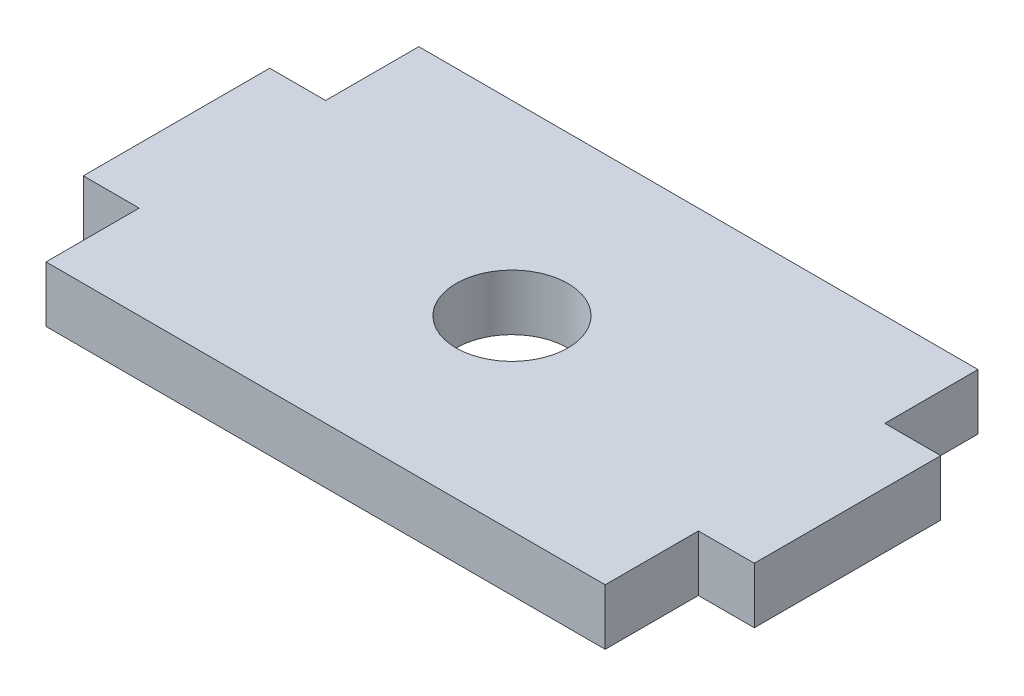
ISO-10303-21;
HEADER;
FILE_DESCRIPTION(('STEP AP214'),'2;1');
FILE_NAME('part.step','',(''),(''),'','','');
FILE_SCHEMA(('AUTOMOTIVE_DESIGN { 1 0 10303 214 1 1 1 1 }'));
ENDSEC;
DATA;
#1=APPLICATION_CONTEXT('core data for automotive mechanical design processes');
#2=APPLICATION_PROTOCOL_DEFINITION('international standard','automotive_design',2000,#1);
#3=PRODUCT_CONTEXT('',#1,'mechanical');
#4=PRODUCT('Part','Part','',(#3));
#5=PRODUCT_RELATED_PRODUCT_CATEGORY('part','',(#4));
#6=PRODUCT_DEFINITION_FORMATION('','',#4);
#7=PRODUCT_DEFINITION_CONTEXT('part definition',#1,'design');
#8=PRODUCT_DEFINITION('design','',#6,#7);
#9=PRODUCT_DEFINITION_SHAPE('','',#8);
#10=(LENGTH_UNIT() NAMED_UNIT(*) SI_UNIT(.MILLI.,.METRE.));
#11=(NAMED_UNIT(*) PLANE_ANGLE_UNIT() SI_UNIT($,.RADIAN.));
#12=(NAMED_UNIT(*) SI_UNIT($,.STERADIAN.) SOLID_ANGLE_UNIT());
#13=UNCERTAINTY_MEASURE_WITH_UNIT(LENGTH_MEASURE(1.E-05),#10,'distance_accuracy_value','');
#14=(GEOMETRIC_REPRESENTATION_CONTEXT(3) GLOBAL_UNCERTAINTY_ASSIGNED_CONTEXT((#13)) GLOBAL_UNIT_ASSIGNED_CONTEXT((#10,
#11,#12)) REPRESENTATION_CONTEXT('',''));
#15=CARTESIAN_POINT('',(0.,0.,0.));
#16=DIRECTION('',(0.,0.,1.));
#17=DIRECTION('',(1.,0.,0.));
#18=AXIS2_PLACEMENT_3D('',#15,#16,#17);
#19=CARTESIAN_POINT('',(0.,3.,0.));
#20=DIRECTION('',(0.,-1.,0.));
#21=DIRECTION('',(0.,0.,-1.));
#22=AXIS2_PLACEMENT_3D('',#19,#20,#21);
#23=PLANE('',#22);
#24=DIRECTION('',(0.,0.,1.));
#25=VECTOR('',#24,1.);
#26=CARTESIAN_POINT('',(-15.,3.,5.));
#27=LINE('',#26,#25);
#28=CARTESIAN_POINT('',(-15.,3.,5.));
#29=VERTEX_POINT('',#28);
#30=CARTESIAN_POINT('',(-15.,3.,10.));
#31=VERTEX_POINT('',#30);
#32=EDGE_CURVE('E177',#29,#31,#27,.T.);
#33=ORIENTED_EDGE('',*,*,#32,.T.);
#34=DIRECTION('',(1.,0.,0.));
#35=VECTOR('',#34,1.);
#36=CARTESIAN_POINT('',(15.,3.,10.));
#37=LINE('',#36,#35);
#38=CARTESIAN_POINT('',(15.,3.,10.));
#39=VERTEX_POINT('',#38);
#40=EDGE_CURVE('E105',#31,#39,#37,.T.);
#41=ORIENTED_EDGE('',*,*,#40,.T.);
#42=DIRECTION('',(0.,0.,-1.));
#43=VECTOR('',#42,1.);
#44=CARTESIAN_POINT('',(15.,3.,10.));
#45=LINE('',#44,#43);
#46=CARTESIAN_POINT('',(15.,3.,5.));
#47=VERTEX_POINT('',#46);
#48=EDGE_CURVE('E204',#39,#47,#45,.T.);
#49=ORIENTED_EDGE('',*,*,#48,.T.);
#50=DIRECTION('',(1.,0.,0.));
#51=VECTOR('',#50,1.);
#52=CARTESIAN_POINT('',(15.,3.,5.));
#53=LINE('',#52,#51);
#54=CARTESIAN_POINT('',(18.,3.,5.));
#55=VERTEX_POINT('',#54);
#56=EDGE_CURVE('E223',#47,#55,#53,.T.);
#57=ORIENTED_EDGE('',*,*,#56,.T.);
#58=DIRECTION('',(0.,0.,-1.));
#59=VECTOR('',#58,1.);
#60=CARTESIAN_POINT('',(18.,3.,5.));
#61=LINE('',#60,#59);
#62=CARTESIAN_POINT('',(18.,3.,-5.));
#63=VERTEX_POINT('',#62);
#64=EDGE_CURVE('E220',#55,#63,#61,.T.);
#65=ORIENTED_EDGE('',*,*,#64,.T.);
#66=DIRECTION('',(-1.,0.,0.));
#67=VECTOR('',#66,1.);
#68=CARTESIAN_POINT('',(18.,3.,-5.));
#69=LINE('',#68,#67);
#70=CARTESIAN_POINT('',(15.,3.,-5.));
#71=VERTEX_POINT('',#70);
#72=EDGE_CURVE('E222',#63,#71,#69,.T.);
#73=ORIENTED_EDGE('',*,*,#72,.T.);
#74=DIRECTION('',(0.,0.,-1.));
#75=VECTOR('',#74,1.);
#76=CARTESIAN_POINT('',(15.,3.,-5.));
#77=LINE('',#76,#75);
#78=CARTESIAN_POINT('',(15.,3.,-10.));
#79=VERTEX_POINT('',#78);
#80=EDGE_CURVE('E225',#71,#79,#77,.T.);
#81=ORIENTED_EDGE('',*,*,#80,.T.);
#82=DIRECTION('',(-1.,0.,0.));
#83=VECTOR('',#82,1.);
#84=CARTESIAN_POINT('',(15.,3.,-10.));
#85=LINE('',#84,#83);
#86=CARTESIAN_POINT('',(-15.,3.,-10.));
#87=VERTEX_POINT('',#86);
#88=EDGE_CURVE('E231',#79,#87,#85,.T.);
#89=ORIENTED_EDGE('',*,*,#88,.T.);
#90=DIRECTION('',(0.,0.,1.));
#91=VECTOR('',#90,1.);
#92=CARTESIAN_POINT('',(-15.,3.,-10.));
#93=LINE('',#92,#91);
#94=CARTESIAN_POINT('',(-15.,3.,-5.));
#95=VERTEX_POINT('',#94);
#96=EDGE_CURVE('E136',#87,#95,#93,.T.);
#97=ORIENTED_EDGE('',*,*,#96,.T.);
#98=DIRECTION('',(-1.,0.,0.));
#99=VECTOR('',#98,1.);
#100=CARTESIAN_POINT('',(-15.,3.,-5.));
#101=LINE('',#100,#99);
#102=CARTESIAN_POINT('',(-18.,3.,-5.));
#103=VERTEX_POINT('',#102);
#104=EDGE_CURVE('E130',#95,#103,#101,.T.);
#105=ORIENTED_EDGE('',*,*,#104,.T.);
#106=DIRECTION('',(0.,0.,1.));
#107=VECTOR('',#106,1.);
#108=CARTESIAN_POINT('',(-18.,3.,-5.));
#109=LINE('',#108,#107);
#110=CARTESIAN_POINT('',(-18.,3.,5.));
#111=VERTEX_POINT('',#110);
#112=EDGE_CURVE('E134',#103,#111,#109,.T.);
#113=ORIENTED_EDGE('',*,*,#112,.T.);
#114=DIRECTION('',(1.,0.,0.));
#115=VECTOR('',#114,1.);
#116=CARTESIAN_POINT('',(-18.,3.,5.));
#117=LINE('',#116,#115);
#118=EDGE_CURVE('E50',#111,#29,#117,.T.);
#119=ORIENTED_EDGE('',*,*,#118,.T.);
#120=EDGE_LOOP('',(#33,#41,#49,#57,#65,#73,#81,#89,#97,#105,#113,#119));
#121=FACE_BOUND('',#120,.T.);
#122=CARTESIAN_POINT('',(0.,3.,0.));
#123=DIRECTION('',(0.,1.,0.));
#124=DIRECTION('',(0.,0.,1.));
#125=AXIS2_PLACEMENT_3D('',#122,#123,#124);
#126=CIRCLE('',#125,3.);
#127=CARTESIAN_POINT('',(0.,3.,3.));
#128=VERTEX_POINT('',#127);
#129=EDGE_CURVE('E158',#128,#128,#126,.T.);
#130=ORIENTED_EDGE('',*,*,#129,.F.);
#131=EDGE_LOOP('',(#130));
#132=FACE_BOUND('',#131,.T.);
#133=ADVANCED_FACE('F33',(#121,#132),#23,.F.);
#134=CARTESIAN_POINT('',(0.,0.,0.));
#135=DIRECTION('',(0.,-1.,0.));
#136=DIRECTION('',(0.,0.,-1.));
#137=AXIS2_PLACEMENT_3D('',#134,#135,#136);
#138=PLANE('',#137);
#139=DIRECTION('',(0.,0.,1.));
#140=VECTOR('',#139,1.);
#141=CARTESIAN_POINT('',(-15.,0.,5.));
#142=LINE('',#141,#140);
#143=CARTESIAN_POINT('',(-15.,0.,5.));
#144=VERTEX_POINT('',#143);
#145=CARTESIAN_POINT('',(-15.,0.,10.));
#146=VERTEX_POINT('',#145);
#147=EDGE_CURVE('E154',#144,#146,#142,.T.);
#148=ORIENTED_EDGE('',*,*,#147,.F.);
#149=DIRECTION('',(1.,0.,0.));
#150=VECTOR('',#149,1.);
#151=CARTESIAN_POINT('',(-18.,0.,5.));
#152=LINE('',#151,#150);
#153=CARTESIAN_POINT('',(-18.,0.,5.));
#154=VERTEX_POINT('',#153);
#155=EDGE_CURVE('E97',#154,#144,#152,.T.);
#156=ORIENTED_EDGE('',*,*,#155,.F.);
#157=DIRECTION('',(0.,0.,1.));
#158=VECTOR('',#157,1.);
#159=CARTESIAN_POINT('',(-18.,0.,-5.));
#160=LINE('',#159,#158);
#161=CARTESIAN_POINT('',(-18.,0.,-5.));
#162=VERTEX_POINT('',#161);
#163=EDGE_CURVE('E91',#162,#154,#160,.T.);
#164=ORIENTED_EDGE('',*,*,#163,.F.);
#165=DIRECTION('',(-1.,0.,0.));
#166=VECTOR('',#165,1.);
#167=CARTESIAN_POINT('',(-15.,0.,-5.));
#168=LINE('',#167,#166);
#169=CARTESIAN_POINT('',(-15.,0.,-5.));
#170=VERTEX_POINT('',#169);
#171=EDGE_CURVE('E144',#170,#162,#168,.T.);
#172=ORIENTED_EDGE('',*,*,#171,.F.);
#173=DIRECTION('',(0.,0.,1.));
#174=VECTOR('',#173,1.);
#175=CARTESIAN_POINT('',(-15.,0.,-10.));
#176=LINE('',#175,#174);
#177=CARTESIAN_POINT('',(-15.,0.,-10.));
#178=VERTEX_POINT('',#177);
#179=EDGE_CURVE('E172',#178,#170,#176,.T.);
#180=ORIENTED_EDGE('',*,*,#179,.F.);
#181=DIRECTION('',(-1.,0.,0.));
#182=VECTOR('',#181,1.);
#183=CARTESIAN_POINT('',(15.,0.,-10.));
#184=LINE('',#183,#182);
#185=CARTESIAN_POINT('',(15.,0.,-10.));
#186=VERTEX_POINT('',#185);
#187=EDGE_CURVE('E170',#186,#178,#184,.T.);
#188=ORIENTED_EDGE('',*,*,#187,.F.);
#189=DIRECTION('',(0.,0.,-1.));
#190=VECTOR('',#189,1.);
#191=CARTESIAN_POINT('',(15.,0.,-5.));
#192=LINE('',#191,#190);
#193=CARTESIAN_POINT('',(15.,0.,-5.));
#194=VERTEX_POINT('',#193);
#195=EDGE_CURVE('E168',#194,#186,#192,.T.);
#196=ORIENTED_EDGE('',*,*,#195,.F.);
#197=DIRECTION('',(-1.,0.,0.));
#198=VECTOR('',#197,1.);
#199=CARTESIAN_POINT('',(18.,0.,-5.));
#200=LINE('',#199,#198);
#201=CARTESIAN_POINT('',(18.,0.,-5.));
#202=VERTEX_POINT('',#201);
#203=EDGE_CURVE('E166',#202,#194,#200,.T.);
#204=ORIENTED_EDGE('',*,*,#203,.F.);
#205=DIRECTION('',(0.,0.,-1.));
#206=VECTOR('',#205,1.);
#207=CARTESIAN_POINT('',(18.,0.,5.));
#208=LINE('',#207,#206);
#209=CARTESIAN_POINT('',(18.,0.,5.));
#210=VERTEX_POINT('',#209);
#211=EDGE_CURVE('E164',#210,#202,#208,.T.);
#212=ORIENTED_EDGE('',*,*,#211,.F.);
#213=DIRECTION('',(1.,0.,0.));
#214=VECTOR('',#213,1.);
#215=CARTESIAN_POINT('',(15.,0.,5.));
#216=LINE('',#215,#214);
#217=CARTESIAN_POINT('',(15.,0.,5.));
#218=VERTEX_POINT('',#217);
#219=EDGE_CURVE('E162',#218,#210,#216,.T.);
#220=ORIENTED_EDGE('',*,*,#219,.F.);
#221=DIRECTION('',(0.,0.,-1.));
#222=VECTOR('',#221,1.);
#223=CARTESIAN_POINT('',(15.,0.,10.));
#224=LINE('',#223,#222);
#225=CARTESIAN_POINT('',(15.,0.,10.));
#226=VERTEX_POINT('',#225);
#227=EDGE_CURVE('E160',#226,#218,#224,.T.);
#228=ORIENTED_EDGE('',*,*,#227,.F.);
#229=DIRECTION('',(1.,0.,0.));
#230=VECTOR('',#229,1.);
#231=CARTESIAN_POINT('',(15.,0.,10.));
#232=LINE('',#231,#230);
#233=EDGE_CURVE('E157',#146,#226,#232,.T.);
#234=ORIENTED_EDGE('',*,*,#233,.F.);
#235=EDGE_LOOP('',(#148,#156,#164,#172,#180,#188,#196,#204,#212,#220,#228,#234));
#236=FACE_BOUND('',#235,.T.);
#237=CARTESIAN_POINT('',(0.,0.,0.));
#238=DIRECTION('',(0.,1.,0.));
#239=DIRECTION('',(0.,0.,1.));
#240=AXIS2_PLACEMENT_3D('',#237,#238,#239);
#241=CIRCLE('',#240,3.);
#242=CARTESIAN_POINT('',(0.,0.,3.));
#243=VERTEX_POINT('',#242);
#244=EDGE_CURVE('E378',#243,#243,#241,.T.);
#245=ORIENTED_EDGE('',*,*,#244,.T.);
#246=EDGE_LOOP('',(#245));
#247=FACE_BOUND('',#246,.T.);
#248=ADVANCED_FACE('F208',(#236,#247),#138,.T.);
#249=CARTESIAN_POINT('',(-15.,3.,5.));
#250=DIRECTION('',(1.,0.,0.));
#251=DIRECTION('',(0.,0.,-1.));
#252=AXIS2_PLACEMENT_3D('',#249,#250,#251);
#253=PLANE('',#252);
#254=ORIENTED_EDGE('',*,*,#147,.T.);
#255=DIRECTION('',(0.,-1.,0.));
#256=VECTOR('',#255,1.);
#257=CARTESIAN_POINT('',(-15.,3.,10.));
#258=LINE('',#257,#256);
#259=EDGE_CURVE('E11',#31,#146,#258,.T.);
#260=ORIENTED_EDGE('',*,*,#259,.F.);
#261=ORIENTED_EDGE('',*,*,#32,.F.);
#262=DIRECTION('',(0.,-1.,0.));
#263=VECTOR('',#262,1.);
#264=CARTESIAN_POINT('',(-15.,3.,5.));
#265=LINE('',#264,#263);
#266=EDGE_CURVE('E150',#29,#144,#265,.T.);
#267=ORIENTED_EDGE('',*,*,#266,.T.);
#268=EDGE_LOOP('',(#254,#260,#261,#267));
#269=FACE_BOUND('',#268,.T.);
#270=ADVANCED_FACE('F35',(#269),#253,.F.);
#271=CARTESIAN_POINT('',(15.,3.,10.));
#272=DIRECTION('',(0.,0.,-1.));
#273=DIRECTION('',(-1.,0.,0.));
#274=AXIS2_PLACEMENT_3D('',#271,#272,#273);
#275=PLANE('',#274);
#276=ORIENTED_EDGE('',*,*,#233,.T.);
#277=DIRECTION('',(0.,-1.,0.));
#278=VECTOR('',#277,1.);
#279=CARTESIAN_POINT('',(15.,3.,10.));
#280=LINE('',#279,#278);
#281=EDGE_CURVE('E42',#39,#226,#280,.T.);
#282=ORIENTED_EDGE('',*,*,#281,.F.);
#283=ORIENTED_EDGE('',*,*,#40,.F.);
#284=ORIENTED_EDGE('',*,*,#259,.T.);
#285=EDGE_LOOP('',(#276,#282,#283,#284));
#286=FACE_BOUND('',#285,.T.);
#287=ADVANCED_FACE('F265',(#286),#275,.F.);
#288=CARTESIAN_POINT('',(15.,3.,10.));
#289=DIRECTION('',(-1.,0.,0.));
#290=DIRECTION('',(0.,0.,1.));
#291=AXIS2_PLACEMENT_3D('',#288,#289,#290);
#292=PLANE('',#291);
#293=ORIENTED_EDGE('',*,*,#227,.T.);
#294=DIRECTION('',(0.,-1.,0.));
#295=VECTOR('',#294,1.);
#296=CARTESIAN_POINT('',(15.,3.,5.));
#297=LINE('',#296,#295);
#298=EDGE_CURVE('E196',#47,#218,#297,.T.);
#299=ORIENTED_EDGE('',*,*,#298,.F.);
#300=ORIENTED_EDGE('',*,*,#48,.F.);
#301=ORIENTED_EDGE('',*,*,#281,.T.);
#302=EDGE_LOOP('',(#293,#299,#300,#301));
#303=FACE_BOUND('',#302,.T.);
#304=ADVANCED_FACE('F202',(#303),#292,.F.);
#305=CARTESIAN_POINT('',(15.,3.,5.));
#306=DIRECTION('',(0.,0.,-1.));
#307=DIRECTION('',(-1.,0.,0.));
#308=AXIS2_PLACEMENT_3D('',#305,#306,#307);
#309=PLANE('',#308);
#310=ORIENTED_EDGE('',*,*,#219,.T.);
#311=DIRECTION('',(0.,-1.,0.));
#312=VECTOR('',#311,1.);
#313=CARTESIAN_POINT('',(18.,3.,5.));
#314=LINE('',#313,#312);
#315=EDGE_CURVE('E193',#55,#210,#314,.T.);
#316=ORIENTED_EDGE('',*,*,#315,.F.);
#317=ORIENTED_EDGE('',*,*,#56,.F.);
#318=ORIENTED_EDGE('',*,*,#298,.T.);
#319=EDGE_LOOP('',(#310,#316,#317,#318));
#320=FACE_BOUND('',#319,.T.);
#321=ADVANCED_FACE('F214',(#320),#309,.F.);
#322=CARTESIAN_POINT('',(18.,3.,5.));
#323=DIRECTION('',(-1.,0.,0.));
#324=DIRECTION('',(0.,0.,1.));
#325=AXIS2_PLACEMENT_3D('',#322,#323,#324);
#326=PLANE('',#325);
#327=ORIENTED_EDGE('',*,*,#211,.T.);
#328=DIRECTION('',(0.,-1.,0.));
#329=VECTOR('',#328,1.);
#330=CARTESIAN_POINT('',(18.,3.,-5.));
#331=LINE('',#330,#329);
#332=EDGE_CURVE('E190',#63,#202,#331,.T.);
#333=ORIENTED_EDGE('',*,*,#332,.F.);
#334=ORIENTED_EDGE('',*,*,#64,.F.);
#335=ORIENTED_EDGE('',*,*,#315,.T.);
#336=EDGE_LOOP('',(#327,#333,#334,#335));
#337=FACE_BOUND('',#336,.T.);
#338=ADVANCED_FACE('F218',(#337),#326,.F.);
#339=CARTESIAN_POINT('',(18.,3.,-5.));
#340=DIRECTION('',(0.,0.,1.));
#341=DIRECTION('',(1.,0.,0.));
#342=AXIS2_PLACEMENT_3D('',#339,#340,#341);
#343=PLANE('',#342);
#344=ORIENTED_EDGE('',*,*,#203,.T.);
#345=DIRECTION('',(0.,-1.,0.));
#346=VECTOR('',#345,1.);
#347=CARTESIAN_POINT('',(15.,3.,-5.));
#348=LINE('',#347,#346);
#349=EDGE_CURVE('E187',#71,#194,#348,.T.);
#350=ORIENTED_EDGE('',*,*,#349,.F.);
#351=ORIENTED_EDGE('',*,*,#72,.F.);
#352=ORIENTED_EDGE('',*,*,#332,.T.);
#353=EDGE_LOOP('',(#344,#350,#351,#352));
#354=FACE_BOUND('',#353,.T.);
#355=ADVANCED_FACE('F278',(#354),#343,.F.);
#356=CARTESIAN_POINT('',(15.,3.,-5.));
#357=DIRECTION('',(-1.,0.,0.));
#358=DIRECTION('',(0.,0.,1.));
#359=AXIS2_PLACEMENT_3D('',#356,#357,#358);
#360=PLANE('',#359);
#361=ORIENTED_EDGE('',*,*,#195,.T.);
#362=DIRECTION('',(0.,-1.,0.));
#363=VECTOR('',#362,1.);
#364=CARTESIAN_POINT('',(15.,3.,-10.));
#365=LINE('',#364,#363);
#366=EDGE_CURVE('E184',#79,#186,#365,.T.);
#367=ORIENTED_EDGE('',*,*,#366,.F.);
#368=ORIENTED_EDGE('',*,*,#80,.F.);
#369=ORIENTED_EDGE('',*,*,#349,.T.);
#370=EDGE_LOOP('',(#361,#367,#368,#369));
#371=FACE_BOUND('',#370,.T.);
#372=ADVANCED_FACE('F281',(#371),#360,.F.);
#373=CARTESIAN_POINT('',(15.,3.,-10.));
#374=DIRECTION('',(0.,0.,1.));
#375=DIRECTION('',(1.,0.,0.));
#376=AXIS2_PLACEMENT_3D('',#373,#374,#375);
#377=PLANE('',#376);
#378=ORIENTED_EDGE('',*,*,#187,.T.);
#379=DIRECTION('',(0.,-1.,0.));
#380=VECTOR('',#379,1.);
#381=CARTESIAN_POINT('',(-15.,3.,-10.));
#382=LINE('',#381,#380);
#383=EDGE_CURVE('E181',#87,#178,#382,.T.);
#384=ORIENTED_EDGE('',*,*,#383,.F.);
#385=ORIENTED_EDGE('',*,*,#88,.F.);
#386=ORIENTED_EDGE('',*,*,#366,.T.);
#387=EDGE_LOOP('',(#378,#384,#385,#386));
#388=FACE_BOUND('',#387,.T.);
#389=ADVANCED_FACE('F237',(#388),#377,.F.);
#390=CARTESIAN_POINT('',(-15.,3.,-10.));
#391=DIRECTION('',(1.,0.,0.));
#392=DIRECTION('',(0.,0.,-1.));
#393=AXIS2_PLACEMENT_3D('',#390,#391,#392);
#394=PLANE('',#393);
#395=ORIENTED_EDGE('',*,*,#179,.T.);
#396=DIRECTION('',(0.,-1.,0.));
#397=VECTOR('',#396,1.);
#398=CARTESIAN_POINT('',(-15.,3.,-5.));
#399=LINE('',#398,#397);
#400=EDGE_CURVE('E145',#95,#170,#399,.T.);
#401=ORIENTED_EDGE('',*,*,#400,.F.);
#402=ORIENTED_EDGE('',*,*,#96,.F.);
#403=ORIENTED_EDGE('',*,*,#383,.T.);
#404=EDGE_LOOP('',(#395,#401,#402,#403));
#405=FACE_BOUND('',#404,.T.);
#406=ADVANCED_FACE('F241',(#405),#394,.F.);
#407=CARTESIAN_POINT('',(-15.,3.,-5.));
#408=DIRECTION('',(0.,0.,1.));
#409=DIRECTION('',(1.,0.,0.));
#410=AXIS2_PLACEMENT_3D('',#407,#408,#409);
#411=PLANE('',#410);
#412=ORIENTED_EDGE('',*,*,#171,.T.);
#413=DIRECTION('',(0.,-1.,0.));
#414=VECTOR('',#413,1.);
#415=CARTESIAN_POINT('',(-18.,3.,-5.));
#416=LINE('',#415,#414);
#417=EDGE_CURVE('E141',#103,#162,#416,.T.);
#418=ORIENTED_EDGE('',*,*,#417,.F.);
#419=ORIENTED_EDGE('',*,*,#104,.F.);
#420=ORIENTED_EDGE('',*,*,#400,.T.);
#421=EDGE_LOOP('',(#412,#418,#419,#420));
#422=FACE_BOUND('',#421,.T.);
#423=ADVANCED_FACE('F142',(#422),#411,.F.);
#424=CARTESIAN_POINT('',(-18.,3.,-5.));
#425=DIRECTION('',(1.,0.,0.));
#426=DIRECTION('',(0.,0.,-1.));
#427=AXIS2_PLACEMENT_3D('',#424,#425,#426);
#428=PLANE('',#427);
#429=ORIENTED_EDGE('',*,*,#163,.T.);
#430=DIRECTION('',(0.,-1.,0.));
#431=VECTOR('',#430,1.);
#432=CARTESIAN_POINT('',(-18.,3.,5.));
#433=LINE('',#432,#431);
#434=EDGE_CURVE('E146',#111,#154,#433,.T.);
#435=ORIENTED_EDGE('',*,*,#434,.F.);
#436=ORIENTED_EDGE('',*,*,#112,.F.);
#437=ORIENTED_EDGE('',*,*,#417,.T.);
#438=EDGE_LOOP('',(#429,#435,#436,#437));
#439=FACE_BOUND('',#438,.T.);
#440=ADVANCED_FACE('F148',(#439),#428,.F.);
#441=CARTESIAN_POINT('',(-18.,3.,5.));
#442=DIRECTION('',(0.,0.,-1.));
#443=DIRECTION('',(-1.,0.,0.));
#444=AXIS2_PLACEMENT_3D('',#441,#442,#443);
#445=PLANE('',#444);
#446=ORIENTED_EDGE('',*,*,#155,.T.);
#447=ORIENTED_EDGE('',*,*,#266,.F.);
#448=ORIENTED_EDGE('',*,*,#118,.F.);
#449=ORIENTED_EDGE('',*,*,#434,.T.);
#450=EDGE_LOOP('',(#446,#447,#448,#449));
#451=FACE_BOUND('',#450,.T.);
#452=ADVANCED_FACE('F245',(#451),#445,.F.);
#453=CARTESIAN_POINT('',(0.,3.,0.));
#454=DIRECTION('',(0.,-1.,0.));
#455=DIRECTION('',(0.,0.,-1.));
#456=AXIS2_PLACEMENT_3D('',#453,#454,#455);
#457=CYLINDRICAL_SURFACE('',#456,3.);
#458=ORIENTED_EDGE('',*,*,#129,.T.);
#459=EDGE_LOOP('',(#458));
#460=FACE_BOUND('',#459,.T.);
#461=ORIENTED_EDGE('',*,*,#244,.F.);
#462=EDGE_LOOP('',(#461));
#463=FACE_BOUND('',#462,.T.);
#464=ADVANCED_FACE('F247',(#460,#463),#457,.F.);
#465=CLOSED_SHELL('',(#133,#248,#270,#287,#304,#321,#338,#355,#372,#389,#406,#423,#440,#452,#464));
#466=MANIFOLD_SOLID_BREP('B2',#465);
#467=ADVANCED_BREP_SHAPE_REPRESENTATION('',(#18,#466),#14);
#468=SHAPE_DEFINITION_REPRESENTATION(#9,#467);
ENDSEC;
END-ISO-10303-21;
